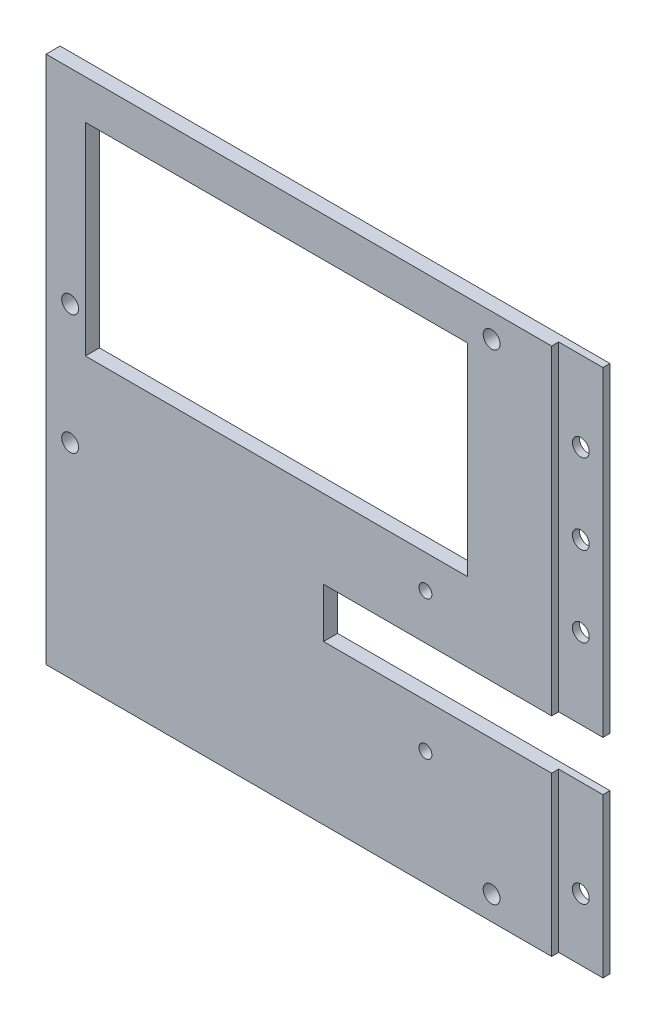
ISO-10303-21;
HEADER;
FILE_DESCRIPTION(('STEP AP214'),'2;1');
FILE_NAME('part.step','',(''),(''),'','','');
FILE_SCHEMA(('AUTOMOTIVE_DESIGN { 1 0 10303 214 1 1 1 1 }'));
ENDSEC;
DATA;
#1=APPLICATION_CONTEXT('core data for automotive mechanical design processes');
#2=APPLICATION_PROTOCOL_DEFINITION('international standard','automotive_design',2000,#1);
#3=PRODUCT_CONTEXT('',#1,'mechanical');
#4=PRODUCT('Part','Part','',(#3));
#5=PRODUCT_RELATED_PRODUCT_CATEGORY('part','',(#4));
#6=PRODUCT_DEFINITION_FORMATION('','',#4);
#7=PRODUCT_DEFINITION_CONTEXT('part definition',#1,'design');
#8=PRODUCT_DEFINITION('design','',#6,#7);
#9=PRODUCT_DEFINITION_SHAPE('','',#8);
#10=(LENGTH_UNIT() NAMED_UNIT(*) SI_UNIT(.MILLI.,.METRE.));
#11=(NAMED_UNIT(*) PLANE_ANGLE_UNIT() SI_UNIT($,.RADIAN.));
#12=(NAMED_UNIT(*) SI_UNIT($,.STERADIAN.) SOLID_ANGLE_UNIT());
#13=UNCERTAINTY_MEASURE_WITH_UNIT(LENGTH_MEASURE(1.E-05),#10,'distance_accuracy_value','');
#14=(GEOMETRIC_REPRESENTATION_CONTEXT(3) GLOBAL_UNCERTAINTY_ASSIGNED_CONTEXT((#13)) GLOBAL_UNIT_ASSIGNED_CONTEXT((#10,
#11,#12)) REPRESENTATION_CONTEXT('',''));
#15=CARTESIAN_POINT('',(0.,0.,0.));
#16=DIRECTION('',(0.,0.,1.));
#17=DIRECTION('',(1.,0.,0.));
#18=AXIS2_PLACEMENT_3D('',#15,#16,#17);
#19=CARTESIAN_POINT('',(0.,0.,3.175));
#20=DIRECTION('',(0.,0.,1.));
#21=DIRECTION('',(1.,0.,0.));
#22=AXIS2_PLACEMENT_3D('',#19,#20,#21);
#23=PLANE('',#22);
#24=CARTESIAN_POINT('',(64.3536557377049,-53.2993903200624,3.175));
#25=DIRECTION('',(0.,0.,1.));
#26=DIRECTION('',(1.,0.,0.));
#27=AXIS2_PLACEMENT_3D('',#24,#25,#26);
#28=CIRCLE('',#27,1.46);
#29=CARTESIAN_POINT('',(65.8136557377049,-53.2993903200624,3.175));
#30=VERTEX_POINT('',#29);
#31=EDGE_CURVE('E277',#30,#30,#28,.F.);
#32=ORIENTED_EDGE('',*,*,#31,.T.);
#33=EDGE_LOOP('',(#32));
#34=FACE_BOUND('',#33,.T.);
#35=CARTESIAN_POINT('',(-15.8673442622951,-64.4223903200624,3.175));
#36=DIRECTION('',(0.,0.,1.));
#37=DIRECTION('',(1.,0.,0.));
#38=AXIS2_PLACEMENT_3D('',#35,#36,#37);
#39=CIRCLE('',#38,1.905);
#40=CARTESIAN_POINT('',(-13.9623442622951,-64.4223903200624,3.175));
#41=VERTEX_POINT('',#40);
#42=EDGE_CURVE('E266',#41,#41,#39,.F.);
#43=ORIENTED_EDGE('',*,*,#42,.T.);
#44=EDGE_LOOP('',(#43));
#45=FACE_BOUND('',#44,.T.);
#46=DIRECTION('',(-1.,0.,0.));
#47=VECTOR('',#46,1.);
#48=CARTESIAN_POINT('',(0.,-45.7703903200625,3.175));
#49=LINE('',#48,#47);
#50=CARTESIAN_POINT('',(73.8706557377049,-45.7703903200625,3.175));
#51=VERTEX_POINT('',#50);
#52=CARTESIAN_POINT('',(-12.4293442622951,-45.7703903200625,3.175));
#53=VERTEX_POINT('',#52);
#54=EDGE_CURVE('E260',#51,#53,#49,.T.);
#55=ORIENTED_EDGE('',*,*,#54,.T.);
#56=DIRECTION('',(0.,1.,0.));
#57=VECTOR('',#56,1.);
#58=CARTESIAN_POINT('',(-12.4293442622951,0.,3.175));
#59=LINE('',#58,#57);
#60=CARTESIAN_POINT('',(-12.4293442622951,-0.0703903200624523,3.175));
#61=VERTEX_POINT('',#60);
#62=EDGE_CURVE('E263',#53,#61,#59,.T.);
#63=ORIENTED_EDGE('',*,*,#62,.T.);
#64=DIRECTION('',(1.,0.,0.));
#65=VECTOR('',#64,1.);
#66=CARTESIAN_POINT('',(0.,-0.070390320062452,3.175));
#67=LINE('',#66,#65);
#68=CARTESIAN_POINT('',(73.8706557377049,-0.0703903200624503,3.175));
#69=VERTEX_POINT('',#68);
#70=EDGE_CURVE('E254',#61,#69,#67,.T.);
#71=ORIENTED_EDGE('',*,*,#70,.T.);
#72=DIRECTION('',(0.,-1.,0.));
#73=VECTOR('',#72,1.);
#74=CARTESIAN_POINT('',(73.8706557377049,0.,3.175));
#75=LINE('',#74,#73);
#76=EDGE_CURVE('E257',#69,#51,#75,.T.);
#77=ORIENTED_EDGE('',*,*,#76,.T.);
#78=EDGE_LOOP('',(#55,#63,#71,#77));
#79=FACE_BOUND('',#78,.T.);
#80=CARTESIAN_POINT('',(79.3026557377049,3.36760967993755,3.175));
#81=DIRECTION('',(0.,0.,1.));
#82=DIRECTION('',(1.,0.,0.));
#83=AXIS2_PLACEMENT_3D('',#80,#81,#82);
#84=CIRCLE('',#83,1.90500000000001);
#85=CARTESIAN_POINT('',(81.2076557377049,3.36760967993755,3.175));
#86=VERTEX_POINT('',#85);
#87=EDGE_CURVE('E251',#86,#86,#84,.F.);
#88=ORIENTED_EDGE('',*,*,#87,.T.);
#89=EDGE_LOOP('',(#88));
#90=FACE_BOUND('',#89,.T.);
#91=CARTESIAN_POINT('',(79.3006557377049,-105.108390320062,3.175));
#92=DIRECTION('',(0.,0.,1.));
#93=DIRECTION('',(1.,0.,0.));
#94=AXIS2_PLACEMENT_3D('',#91,#92,#93);
#95=CIRCLE('',#94,1.90500000000001);
#96=CARTESIAN_POINT('',(81.2056557377049,-105.108390320062,3.175));
#97=VERTEX_POINT('',#96);
#98=EDGE_CURVE('E248',#97,#97,#95,.F.);
#99=ORIENTED_EDGE('',*,*,#98,.T.);
#100=EDGE_LOOP('',(#99));
#101=FACE_BOUND('',#100,.T.);
#102=CARTESIAN_POINT('',(64.3536557377049,-84.6493903200624,3.175));
#103=DIRECTION('',(0.,0.,1.));
#104=DIRECTION('',(1.,0.,0.));
#105=AXIS2_PLACEMENT_3D('',#102,#103,#104);
#106=CIRCLE('',#105,1.45999999999998);
#107=CARTESIAN_POINT('',(65.8136557377049,-84.6493903200624,3.175));
#108=VERTEX_POINT('',#107);
#109=EDGE_CURVE('E245',#108,#108,#106,.F.);
#110=ORIENTED_EDGE('',*,*,#109,.T.);
#111=EDGE_LOOP('',(#110));
#112=FACE_BOUND('',#111,.T.);
#113=CARTESIAN_POINT('',(-15.8673442622951,-37.3203903200625,3.175));
#114=DIRECTION('',(0.,0.,1.));
#115=DIRECTION('',(1.,0.,0.));
#116=AXIS2_PLACEMENT_3D('',#113,#114,#115);
#117=CIRCLE('',#116,1.905);
#118=CARTESIAN_POINT('',(-13.9623442622951,-37.3203903200625,3.175));
#119=VERTEX_POINT('',#118);
#120=EDGE_CURVE('E242',#119,#119,#117,.F.);
#121=ORIENTED_EDGE('',*,*,#120,.T.);
#122=EDGE_LOOP('',(#121));
#123=FACE_BOUND('',#122,.T.);
#124=DIRECTION('',(1.,0.,0.));
#125=VECTOR('',#124,1.);
#126=CARTESIAN_POINT('',(-21.3193442622951,-110.560390320062,3.175));
#127=LINE('',#126,#125);
#128=CARTESIAN_POINT('',(-21.3193442622951,-110.560390320062,3.175));
#129=VERTEX_POINT('',#128);
#130=CARTESIAN_POINT('',(92.8536557377049,-110.560390320062,3.17500006353088));
#131=VERTEX_POINT('',#130);
#132=EDGE_CURVE('E284',#129,#131,#127,.T.);
#133=ORIENTED_EDGE('',*,*,#132,.T.);
#134=DIRECTION('',(0.,-1.,0.));
#135=VECTOR('',#134,1.);
#136=CARTESIAN_POINT('',(92.8536557377049,8.81961037541127,3.17500006353089));
#137=LINE('',#136,#135);
#138=CARTESIAN_POINT('',(92.8536557377049,-74.7133903200625,3.17500006353088));
#139=VERTEX_POINT('',#138);
#140=EDGE_CURVE('E331',#139,#131,#137,.T.);
#141=ORIENTED_EDGE('',*,*,#140,.F.);
#142=DIRECTION('',(-1.,0.,0.));
#143=VECTOR('',#142,1.);
#144=CARTESIAN_POINT('',(0.,-74.7133903200625,3.175));
#145=LINE('',#144,#143);
#146=CARTESIAN_POINT('',(41.3536557377049,-74.7133903200625,3.175));
#147=VERTEX_POINT('',#146);
#148=EDGE_CURVE('E272',#139,#147,#145,.T.);
#149=ORIENTED_EDGE('',*,*,#148,.T.);
#150=DIRECTION('',(0.,1.,0.));
#151=VECTOR('',#150,1.);
#152=CARTESIAN_POINT('',(41.3536557377049,0.,3.175));
#153=LINE('',#152,#151);
#154=CARTESIAN_POINT('',(41.3536557377049,-63.5133903200624,3.175));
#155=VERTEX_POINT('',#154);
#156=EDGE_CURVE('E274',#147,#155,#153,.T.);
#157=ORIENTED_EDGE('',*,*,#156,.T.);
#158=DIRECTION('',(1.,0.,0.));
#159=VECTOR('',#158,1.);
#160=CARTESIAN_POINT('',(0.,-63.5133903200624,3.175));
#161=LINE('',#160,#159);
#162=CARTESIAN_POINT('',(92.8536557377049,-63.5133903200624,3.175));
#163=VERTEX_POINT('',#162);
#164=EDGE_CURVE('E269',#155,#163,#161,.T.);
#165=ORIENTED_EDGE('',*,*,#164,.T.);
#166=CARTESIAN_POINT('',(92.8536557377049,8.81961037541127,3.17500006353089));
#167=VERTEX_POINT('',#166);
#168=EDGE_CURVE('E62',#167,#163,#137,.T.);
#169=ORIENTED_EDGE('',*,*,#168,.F.);
#170=DIRECTION('',(-1.,0.,0.));
#171=VECTOR('',#170,1.);
#172=CARTESIAN_POINT('',(-21.3193442622951,8.81960967993755,3.175));
#173=LINE('',#172,#171);
#174=CARTESIAN_POINT('',(-21.3193442622951,8.81960967993755,3.175));
#175=VERTEX_POINT('',#174);
#176=EDGE_CURVE('E169',#167,#175,#173,.T.);
#177=ORIENTED_EDGE('',*,*,#176,.T.);
#178=DIRECTION('',(0.,-1.,0.));
#179=VECTOR('',#178,1.);
#180=CARTESIAN_POINT('',(-21.3193442622951,8.81960967993755,3.175));
#181=LINE('',#180,#179);
#182=EDGE_CURVE('E281',#175,#129,#181,.T.);
#183=ORIENTED_EDGE('',*,*,#182,.T.);
#184=EDGE_LOOP('',(#133,#141,#149,#157,#165,#169,#177,#183));
#185=FACE_BOUND('',#184,.T.);
#186=ADVANCED_FACE('F37',(#34,#45,#79,#90,#101,#112,#123,#185),#23,.T.);
#187=CARTESIAN_POINT('',(102.853655737705,8.81960967993755,3.175));
#188=DIRECTION('',(-1.,0.,0.));
#189=DIRECTION('',(0.,-1.,0.));
#190=AXIS2_PLACEMENT_3D('',#187,#188,#189);
#191=PLANE('',#190);
#192=DIRECTION('',(0.,0.,-1.));
#193=VECTOR('',#192,1.);
#194=CARTESIAN_POINT('',(102.853655737705,-74.7133903200625,14.175));
#195=LINE('',#194,#193);
#196=CARTESIAN_POINT('',(102.853655737705,-74.7133903200625,1.58500006353088));
#197=VERTEX_POINT('',#196);
#198=CARTESIAN_POINT('',(102.853655737705,-74.7133903200625,0.));
#199=VERTEX_POINT('',#198);
#200=EDGE_CURVE('E209',#197,#199,#195,.T.);
#201=ORIENTED_EDGE('',*,*,#200,.F.);
#202=DIRECTION('',(0.,1.,0.));
#203=VECTOR('',#202,1.);
#204=CARTESIAN_POINT('',(102.853655737705,8.81961037541127,1.58500006353089));
#205=LINE('',#204,#203);
#206=CARTESIAN_POINT('',(102.853655737705,-110.560390320062,1.58500006353088));
#207=VERTEX_POINT('',#206);
#208=EDGE_CURVE('E173',#207,#197,#205,.T.);
#209=ORIENTED_EDGE('',*,*,#208,.F.);
#210=DIRECTION('',(0.,0.,-1.));
#211=VECTOR('',#210,1.);
#212=CARTESIAN_POINT('',(102.853655737705,-110.560390320062,3.175));
#213=LINE('',#212,#211);
#214=CARTESIAN_POINT('',(102.853655737705,-110.560390320062,0.));
#215=VERTEX_POINT('',#214);
#216=EDGE_CURVE('E304',#207,#215,#213,.T.);
#217=ORIENTED_EDGE('',*,*,#216,.T.);
#218=DIRECTION('',(0.,1.,0.));
#219=VECTOR('',#218,1.);
#220=CARTESIAN_POINT('',(102.853655737705,8.81960967993755,0.));
#221=LINE('',#220,#219);
#222=EDGE_CURVE('E296',#215,#199,#221,.T.);
#223=ORIENTED_EDGE('',*,*,#222,.T.);
#224=EDGE_LOOP('',(#201,#209,#217,#223));
#225=FACE_BOUND('',#224,.T.);
#226=ADVANCED_FACE('F345',(#225),#191,.F.);
#227=DIRECTION('',(0.,0.,-1.));
#228=VECTOR('',#227,1.);
#229=CARTESIAN_POINT('',(102.853655737705,8.81960967993755,3.175));
#230=LINE('',#229,#228);
#231=CARTESIAN_POINT('',(102.853655737705,8.81961037541127,1.58500006353089));
#232=VERTEX_POINT('',#231);
#233=CARTESIAN_POINT('',(102.853655737705,8.81960967993755,0.));
#234=VERTEX_POINT('',#233);
#235=EDGE_CURVE('E302',#232,#234,#230,.T.);
#236=ORIENTED_EDGE('',*,*,#235,.F.);
#237=CARTESIAN_POINT('',(102.853655737705,-63.5133903200624,1.58500006353088));
#238=VERTEX_POINT('',#237);
#239=EDGE_CURVE('E161',#238,#232,#205,.T.);
#240=ORIENTED_EDGE('',*,*,#239,.F.);
#241=DIRECTION('',(0.,0.,-1.));
#242=VECTOR('',#241,1.);
#243=CARTESIAN_POINT('',(102.853655737705,-63.5133903200624,14.175));
#244=LINE('',#243,#242);
#245=CARTESIAN_POINT('',(102.853655737705,-63.5133903200624,0.));
#246=VERTEX_POINT('',#245);
#247=EDGE_CURVE('E207',#238,#246,#244,.T.);
#248=ORIENTED_EDGE('',*,*,#247,.T.);
#249=EDGE_CURVE('E295',#246,#234,#221,.T.);
#250=ORIENTED_EDGE('',*,*,#249,.T.);
#251=EDGE_LOOP('',(#236,#240,#248,#250));
#252=FACE_BOUND('',#251,.T.);
#253=ADVANCED_FACE('F382',(#252),#191,.F.);
#254=CARTESIAN_POINT('',(-21.3193442622951,8.81960967993755,3.175));
#255=DIRECTION('',(1.,0.,0.));
#256=DIRECTION('',(0.,1.,0.));
#257=AXIS2_PLACEMENT_3D('',#254,#255,#256);
#258=PLANE('',#257);
#259=DIRECTION('',(0.,-1.,0.));
#260=VECTOR('',#259,1.);
#261=CARTESIAN_POINT('',(-21.3193442622951,8.81960967993755,0.));
#262=LINE('',#261,#260);
#263=CARTESIAN_POINT('',(-21.3193442622951,8.81960967993755,0.));
#264=VERTEX_POINT('',#263);
#265=CARTESIAN_POINT('',(-21.3193442622951,-110.560390320062,0.));
#266=VERTEX_POINT('',#265);
#267=EDGE_CURVE('E280',#264,#266,#262,.T.);
#268=ORIENTED_EDGE('',*,*,#267,.T.);
#269=DIRECTION('',(0.,0.,-1.));
#270=VECTOR('',#269,1.);
#271=CARTESIAN_POINT('',(-21.3193442622951,-110.560390320062,3.175));
#272=LINE('',#271,#270);
#273=EDGE_CURVE('E306',#129,#266,#272,.T.);
#274=ORIENTED_EDGE('',*,*,#273,.F.);
#275=ORIENTED_EDGE('',*,*,#182,.F.);
#276=DIRECTION('',(0.,0.,-1.));
#277=VECTOR('',#276,1.);
#278=CARTESIAN_POINT('',(-21.3193442622951,8.81960967993755,3.175));
#279=LINE('',#278,#277);
#280=EDGE_CURVE('E289',#175,#264,#279,.T.);
#281=ORIENTED_EDGE('',*,*,#280,.T.);
#282=EDGE_LOOP('',(#268,#274,#275,#281));
#283=FACE_BOUND('',#282,.T.);
#284=ADVANCED_FACE('F39',(#283),#258,.F.);
#285=CARTESIAN_POINT('',(-21.3193442622951,-110.560390320062,3.175));
#286=DIRECTION('',(0.,1.,0.));
#287=DIRECTION('',(0.,0.,1.));
#288=AXIS2_PLACEMENT_3D('',#285,#286,#287);
#289=PLANE('',#288);
#290=ORIENTED_EDGE('',*,*,#216,.F.);
#291=DIRECTION('',(-1.,0.,0.));
#292=VECTOR('',#291,1.);
#293=CARTESIAN_POINT('',(-21.3193442622951,-110.560390320062,1.58500006353088));
#294=LINE('',#293,#292);
#295=CARTESIAN_POINT('',(92.8536557377049,-110.560390320062,1.58500006353088));
#296=VERTEX_POINT('',#295);
#297=EDGE_CURVE('E182',#207,#296,#294,.T.);
#298=ORIENTED_EDGE('',*,*,#297,.T.);
#299=DIRECTION('',(0.,0.,-1.));
#300=VECTOR('',#299,1.);
#301=CARTESIAN_POINT('',(92.8536557377049,-110.560390320062,3.175));
#302=LINE('',#301,#300);
#303=EDGE_CURVE('E178',#131,#296,#302,.T.);
#304=ORIENTED_EDGE('',*,*,#303,.F.);
#305=ORIENTED_EDGE('',*,*,#132,.F.);
#306=ORIENTED_EDGE('',*,*,#273,.T.);
#307=DIRECTION('',(1.,0.,0.));
#308=VECTOR('',#307,1.);
#309=CARTESIAN_POINT('',(-21.3193442622951,-110.560390320062,0.));
#310=LINE('',#309,#308);
#311=EDGE_CURVE('E292',#266,#215,#310,.T.);
#312=ORIENTED_EDGE('',*,*,#311,.T.);
#313=EDGE_LOOP('',(#290,#298,#304,#305,#306,#312));
#314=FACE_BOUND('',#313,.T.);
#315=ADVANCED_FACE('F360',(#314),#289,.F.);
#316=CARTESIAN_POINT('',(-21.3193442622951,8.81960967993755,3.175));
#317=DIRECTION('',(0.,-1.,0.));
#318=DIRECTION('',(0.,0.,-1.));
#319=AXIS2_PLACEMENT_3D('',#316,#317,#318);
#320=PLANE('',#319);
#321=DIRECTION('',(0.,0.,1.));
#322=VECTOR('',#321,1.);
#323=CARTESIAN_POINT('',(92.8536557377049,8.81961037541127,3.17500006353089));
#324=LINE('',#323,#322);
#325=CARTESIAN_POINT('',(92.8536557377049,8.81961037541127,1.58500006353089));
#326=VERTEX_POINT('',#325);
#327=EDGE_CURVE('E153',#326,#167,#324,.T.);
#328=ORIENTED_EDGE('',*,*,#327,.F.);
#329=DIRECTION('',(1.,0.,0.));
#330=VECTOR('',#329,1.);
#331=CARTESIAN_POINT('',(92.8536557377049,8.81961037541127,1.58500006353089));
#332=LINE('',#331,#330);
#333=EDGE_CURVE('E158',#326,#232,#332,.T.);
#334=ORIENTED_EDGE('',*,*,#333,.T.);
#335=ORIENTED_EDGE('',*,*,#235,.T.);
#336=DIRECTION('',(-1.,0.,0.));
#337=VECTOR('',#336,1.);
#338=CARTESIAN_POINT('',(-21.3193442622951,8.81960967993755,0.));
#339=LINE('',#338,#337);
#340=EDGE_CURVE('E285',#234,#264,#339,.T.);
#341=ORIENTED_EDGE('',*,*,#340,.T.);
#342=ORIENTED_EDGE('',*,*,#280,.F.);
#343=ORIENTED_EDGE('',*,*,#176,.F.);
#344=EDGE_LOOP('',(#328,#334,#335,#341,#342,#343));
#345=FACE_BOUND('',#344,.T.);
#346=ADVANCED_FACE('F167',(#345),#320,.F.);
#347=CARTESIAN_POINT('',(0.,0.,0.));
#348=DIRECTION('',(0.,0.,1.));
#349=DIRECTION('',(1.,0.,0.));
#350=AXIS2_PLACEMENT_3D('',#347,#348,#349);
#351=PLANE('',#350);
#352=CARTESIAN_POINT('',(97.8536557377049,-9.26288962458873,0.));
#353=DIRECTION('',(0.,0.,1.));
#354=DIRECTION('',(1.,0.,0.));
#355=AXIS2_PLACEMENT_3D('',#352,#353,#354);
#356=CIRCLE('',#355,1.90500000000001);
#357=CARTESIAN_POINT('',(99.7586557377049,-9.26288962458873,0.));
#358=VERTEX_POINT('',#357);
#359=EDGE_CURVE('E174',#358,#358,#356,.T.);
#360=ORIENTED_EDGE('',*,*,#359,.T.);
#361=EDGE_LOOP('',(#360));
#362=FACE_BOUND('',#361,.T.);
#363=CARTESIAN_POINT('',(97.8536557377049,-27.3453896245887,0.));
#364=DIRECTION('',(0.,0.,1.));
#365=DIRECTION('',(1.,0.,0.));
#366=AXIS2_PLACEMENT_3D('',#363,#364,#365);
#367=CIRCLE('',#366,1.90500000000001);
#368=CARTESIAN_POINT('',(99.7586557377049,-27.3453896245887,0.));
#369=VERTEX_POINT('',#368);
#370=EDGE_CURVE('E319',#369,#369,#367,.T.);
#371=ORIENTED_EDGE('',*,*,#370,.T.);
#372=EDGE_LOOP('',(#371));
#373=FACE_BOUND('',#372,.T.);
#374=CARTESIAN_POINT('',(97.8536557377049,-45.4308903200625,0.));
#375=DIRECTION('',(0.,0.,1.));
#376=DIRECTION('',(1.,0.,0.));
#377=AXIS2_PLACEMENT_3D('',#374,#375,#376);
#378=CIRCLE('',#377,1.90500000000001);
#379=CARTESIAN_POINT('',(99.7586557377049,-45.4308903200625,0.));
#380=VERTEX_POINT('',#379);
#381=EDGE_CURVE('E316',#380,#380,#378,.T.);
#382=ORIENTED_EDGE('',*,*,#381,.T.);
#383=EDGE_LOOP('',(#382));
#384=FACE_BOUND('',#383,.T.);
#385=CARTESIAN_POINT('',(97.8536557377049,-96.5603903200625,0.));
#386=DIRECTION('',(0.,0.,1.));
#387=DIRECTION('',(1.,0.,0.));
#388=AXIS2_PLACEMENT_3D('',#385,#386,#387);
#389=CIRCLE('',#388,1.90500000000001);
#390=CARTESIAN_POINT('',(99.7586557377049,-96.5603903200625,0.));
#391=VERTEX_POINT('',#390);
#392=EDGE_CURVE('E313',#391,#391,#389,.T.);
#393=ORIENTED_EDGE('',*,*,#392,.T.);
#394=EDGE_LOOP('',(#393));
#395=FACE_BOUND('',#394,.T.);
#396=CARTESIAN_POINT('',(64.3536557377049,-53.2993903200624,0.));
#397=DIRECTION('',(0.,0.,1.));
#398=DIRECTION('',(1.,0.,0.));
#399=AXIS2_PLACEMENT_3D('',#396,#397,#398);
#400=CIRCLE('',#399,1.46);
#401=CARTESIAN_POINT('',(65.8136557377049,-53.2993903200624,0.));
#402=VERTEX_POINT('',#401);
#403=EDGE_CURVE('E189',#402,#402,#400,.T.);
#404=ORIENTED_EDGE('',*,*,#403,.T.);
#405=EDGE_LOOP('',(#404));
#406=FACE_BOUND('',#405,.T.);
#407=DIRECTION('',(1.,0.,0.));
#408=VECTOR('',#407,1.);
#409=CARTESIAN_POINT('',(41.3536557377049,-74.7133903200625,0.));
#410=LINE('',#409,#408);
#411=CARTESIAN_POINT('',(41.3536557377049,-74.7133903200625,0.));
#412=VERTEX_POINT('',#411);
#413=EDGE_CURVE('E198',#412,#199,#410,.T.);
#414=ORIENTED_EDGE('',*,*,#413,.T.);
#415=ORIENTED_EDGE('',*,*,#222,.F.);
#416=ORIENTED_EDGE('',*,*,#311,.F.);
#417=ORIENTED_EDGE('',*,*,#267,.F.);
#418=ORIENTED_EDGE('',*,*,#340,.F.);
#419=ORIENTED_EDGE('',*,*,#249,.F.);
#420=DIRECTION('',(-1.,0.,0.));
#421=VECTOR('',#420,1.);
#422=CARTESIAN_POINT('',(41.3536557377049,-63.5133903200624,0.));
#423=LINE('',#422,#421);
#424=CARTESIAN_POINT('',(41.3536557377049,-63.5133903200624,0.));
#425=VERTEX_POINT('',#424);
#426=EDGE_CURVE('E201',#246,#425,#423,.T.);
#427=ORIENTED_EDGE('',*,*,#426,.T.);
#428=DIRECTION('',(0.,-1.,0.));
#429=VECTOR('',#428,1.);
#430=CARTESIAN_POINT('',(41.3536557377049,-63.5133903200624,0.));
#431=LINE('',#430,#429);
#432=EDGE_CURVE('E195',#425,#412,#431,.T.);
#433=ORIENTED_EDGE('',*,*,#432,.T.);
#434=EDGE_LOOP('',(#414,#415,#416,#417,#418,#419,#427,#433));
#435=FACE_BOUND('',#434,.T.);
#436=CARTESIAN_POINT('',(-15.8673442622951,-64.4223903200624,0.));
#437=DIRECTION('',(0.,0.,1.));
#438=DIRECTION('',(1.,0.,0.));
#439=AXIS2_PLACEMENT_3D('',#436,#437,#438);
#440=CIRCLE('',#439,1.905);
#441=CARTESIAN_POINT('',(-13.9623442622951,-64.4223903200624,0.));
#442=VERTEX_POINT('',#441);
#443=EDGE_CURVE('E213',#442,#442,#440,.T.);
#444=ORIENTED_EDGE('',*,*,#443,.T.);
#445=EDGE_LOOP('',(#444));
#446=FACE_BOUND('',#445,.T.);
#447=DIRECTION('',(0.,-1.,0.));
#448=VECTOR('',#447,1.);
#449=CARTESIAN_POINT('',(-12.4293442622951,-0.0703903200624523,0.));
#450=LINE('',#449,#448);
#451=CARTESIAN_POINT('',(-12.4293442622951,-0.0703903200624523,0.));
#452=VERTEX_POINT('',#451);
#453=CARTESIAN_POINT('',(-12.4293442622951,-45.7703903200625,0.));
#454=VERTEX_POINT('',#453);
#455=EDGE_CURVE('E216',#452,#454,#450,.T.);
#456=ORIENTED_EDGE('',*,*,#455,.T.);
#457=DIRECTION('',(1.,0.,0.));
#458=VECTOR('',#457,1.);
#459=CARTESIAN_POINT('',(-12.4293442622951,-45.7703903200625,0.));
#460=LINE('',#459,#458);
#461=CARTESIAN_POINT('',(73.8706557377049,-45.7703903200625,0.));
#462=VERTEX_POINT('',#461);
#463=EDGE_CURVE('E219',#454,#462,#460,.T.);
#464=ORIENTED_EDGE('',*,*,#463,.T.);
#465=DIRECTION('',(0.,1.,0.));
#466=VECTOR('',#465,1.);
#467=CARTESIAN_POINT('',(73.8706557377049,-0.0703903200624503,0.));
#468=LINE('',#467,#466);
#469=CARTESIAN_POINT('',(73.8706557377049,-0.0703903200624503,0.));
#470=VERTEX_POINT('',#469);
#471=EDGE_CURVE('E222',#462,#470,#468,.T.);
#472=ORIENTED_EDGE('',*,*,#471,.T.);
#473=DIRECTION('',(-1.,0.,0.));
#474=VECTOR('',#473,1.);
#475=CARTESIAN_POINT('',(-12.4293442622951,-0.0703903200624523,0.));
#476=LINE('',#475,#474);
#477=EDGE_CURVE('E225',#470,#452,#476,.T.);
#478=ORIENTED_EDGE('',*,*,#477,.T.);
#479=EDGE_LOOP('',(#456,#464,#472,#478));
#480=FACE_BOUND('',#479,.T.);
#481=CARTESIAN_POINT('',(79.3026557377049,3.36760967993755,0.));
#482=DIRECTION('',(0.,0.,1.));
#483=DIRECTION('',(1.,0.,0.));
#484=AXIS2_PLACEMENT_3D('',#481,#482,#483);
#485=CIRCLE('',#484,1.90500000000001);
#486=CARTESIAN_POINT('',(81.2076557377049,3.36760967993755,0.));
#487=VERTEX_POINT('',#486);
#488=EDGE_CURVE('E186',#487,#487,#485,.T.);
#489=ORIENTED_EDGE('',*,*,#488,.T.);
#490=EDGE_LOOP('',(#489));
#491=FACE_BOUND('',#490,.T.);
#492=CARTESIAN_POINT('',(79.3006557377049,-105.108390320062,0.));
#493=DIRECTION('',(0.,0.,1.));
#494=DIRECTION('',(1.,0.,0.));
#495=AXIS2_PLACEMENT_3D('',#492,#493,#494);
#496=CIRCLE('',#495,1.90500000000001);
#497=CARTESIAN_POINT('',(81.2056557377049,-105.108390320062,0.));
#498=VERTEX_POINT('',#497);
#499=EDGE_CURVE('E190',#498,#498,#496,.T.);
#500=ORIENTED_EDGE('',*,*,#499,.T.);
#501=EDGE_LOOP('',(#500));
#502=FACE_BOUND('',#501,.T.);
#503=CARTESIAN_POINT('',(64.3536557377049,-84.6493903200624,0.));
#504=DIRECTION('',(0.,0.,1.));
#505=DIRECTION('',(1.,0.,0.));
#506=AXIS2_PLACEMENT_3D('',#503,#504,#505);
#507=CIRCLE('',#506,1.45999999999998);
#508=CARTESIAN_POINT('',(65.8136557377049,-84.6493903200624,0.));
#509=VERTEX_POINT('',#508);
#510=EDGE_CURVE('E185',#509,#509,#507,.T.);
#511=ORIENTED_EDGE('',*,*,#510,.T.);
#512=EDGE_LOOP('',(#511));
#513=FACE_BOUND('',#512,.T.);
#514=CARTESIAN_POINT('',(-15.8673442622951,-37.3203903200625,0.));
#515=DIRECTION('',(0.,0.,1.));
#516=DIRECTION('',(1.,0.,0.));
#517=AXIS2_PLACEMENT_3D('',#514,#515,#516);
#518=CIRCLE('',#517,1.905);
#519=CARTESIAN_POINT('',(-13.9623442622951,-37.3203903200625,0.));
#520=VERTEX_POINT('',#519);
#521=EDGE_CURVE('E237',#520,#520,#518,.T.);
#522=ORIENTED_EDGE('',*,*,#521,.T.);
#523=EDGE_LOOP('',(#522));
#524=FACE_BOUND('',#523,.T.);
#525=ADVANCED_FACE('F348',(#362,#373,#384,#395,#406,#435,#446,#480,#491,#502,#513,#524),#351,.F.);
#526=CARTESIAN_POINT('',(-15.8673442622951,-37.3203903200625,14.175));
#527=DIRECTION('',(0.,0.,-1.));
#528=DIRECTION('',(-1.,0.,0.));
#529=AXIS2_PLACEMENT_3D('',#526,#527,#528);
#530=CYLINDRICAL_SURFACE('',#529,1.905);
#531=ORIENTED_EDGE('',*,*,#120,.F.);
#532=EDGE_LOOP('',(#531));
#533=FACE_BOUND('',#532,.T.);
#534=ORIENTED_EDGE('',*,*,#521,.F.);
#535=EDGE_LOOP('',(#534));
#536=FACE_BOUND('',#535,.T.);
#537=ADVANCED_FACE('F387',(#533,#536),#530,.F.);
#538=CARTESIAN_POINT('',(64.3536557377049,-84.6493903200624,14.175));
#539=DIRECTION('',(0.,0.,-1.));
#540=DIRECTION('',(-1.,0.,0.));
#541=AXIS2_PLACEMENT_3D('',#538,#539,#540);
#542=CYLINDRICAL_SURFACE('',#541,1.45999999999998);
#543=ORIENTED_EDGE('',*,*,#109,.F.);
#544=EDGE_LOOP('',(#543));
#545=FACE_BOUND('',#544,.T.);
#546=ORIENTED_EDGE('',*,*,#510,.F.);
#547=EDGE_LOOP('',(#546));
#548=FACE_BOUND('',#547,.T.);
#549=ADVANCED_FACE('F419',(#545,#548),#542,.F.);
#550=CARTESIAN_POINT('',(79.3006557377049,-105.108390320062,14.175));
#551=DIRECTION('',(0.,0.,-1.));
#552=DIRECTION('',(-1.,0.,0.));
#553=AXIS2_PLACEMENT_3D('',#550,#551,#552);
#554=CYLINDRICAL_SURFACE('',#553,1.90500000000001);
#555=ORIENTED_EDGE('',*,*,#98,.F.);
#556=EDGE_LOOP('',(#555));
#557=FACE_BOUND('',#556,.T.);
#558=ORIENTED_EDGE('',*,*,#499,.F.);
#559=EDGE_LOOP('',(#558));
#560=FACE_BOUND('',#559,.T.);
#561=ADVANCED_FACE('F463',(#557,#560),#554,.F.);
#562=CARTESIAN_POINT('',(79.3026557377049,3.36760967993755,14.175));
#563=DIRECTION('',(0.,0.,-1.));
#564=DIRECTION('',(-1.,0.,0.));
#565=AXIS2_PLACEMENT_3D('',#562,#563,#564);
#566=CYLINDRICAL_SURFACE('',#565,1.90500000000001);
#567=ORIENTED_EDGE('',*,*,#87,.F.);
#568=EDGE_LOOP('',(#567));
#569=FACE_BOUND('',#568,.T.);
#570=ORIENTED_EDGE('',*,*,#488,.F.);
#571=EDGE_LOOP('',(#570));
#572=FACE_BOUND('',#571,.T.);
#573=ADVANCED_FACE('F439',(#569,#572),#566,.F.);
#574=CARTESIAN_POINT('',(-12.4293442622951,-0.0703903200624523,14.175));
#575=DIRECTION('',(1.,0.,0.));
#576=DIRECTION('',(0.,1.,0.));
#577=AXIS2_PLACEMENT_3D('',#574,#575,#576);
#578=PLANE('',#577);
#579=DIRECTION('',(0.,0.,-1.));
#580=VECTOR('',#579,1.);
#581=CARTESIAN_POINT('',(-12.4293442622951,-45.7703903200625,14.175));
#582=LINE('',#581,#580);
#583=EDGE_CURVE('E235',#53,#454,#582,.T.);
#584=ORIENTED_EDGE('',*,*,#583,.T.);
#585=ORIENTED_EDGE('',*,*,#455,.F.);
#586=DIRECTION('',(0.,0.,-1.));
#587=VECTOR('',#586,1.);
#588=CARTESIAN_POINT('',(-12.4293442622951,-0.0703903200624523,14.175));
#589=LINE('',#588,#587);
#590=EDGE_CURVE('E228',#61,#452,#589,.T.);
#591=ORIENTED_EDGE('',*,*,#590,.F.);
#592=ORIENTED_EDGE('',*,*,#62,.F.);
#593=EDGE_LOOP('',(#584,#585,#591,#592));
#594=FACE_BOUND('',#593,.T.);
#595=ADVANCED_FACE('F436',(#594),#578,.T.);
#596=CARTESIAN_POINT('',(-12.4293442622951,-45.7703903200625,14.175));
#597=DIRECTION('',(0.,1.,0.));
#598=DIRECTION('',(0.,0.,1.));
#599=AXIS2_PLACEMENT_3D('',#596,#597,#598);
#600=PLANE('',#599);
#601=DIRECTION('',(0.,0.,-1.));
#602=VECTOR('',#601,1.);
#603=CARTESIAN_POINT('',(73.8706557377049,-45.7703903200625,14.175));
#604=LINE('',#603,#602);
#605=EDGE_CURVE('E233',#51,#462,#604,.T.);
#606=ORIENTED_EDGE('',*,*,#605,.T.);
#607=ORIENTED_EDGE('',*,*,#463,.F.);
#608=ORIENTED_EDGE('',*,*,#583,.F.);
#609=ORIENTED_EDGE('',*,*,#54,.F.);
#610=EDGE_LOOP('',(#606,#607,#608,#609));
#611=FACE_BOUND('',#610,.T.);
#612=ADVANCED_FACE('F432',(#611),#600,.T.);
#613=CARTESIAN_POINT('',(73.8706557377049,-0.0703903200624503,14.175));
#614=DIRECTION('',(-1.,0.,0.));
#615=DIRECTION('',(0.,0.,1.));
#616=AXIS2_PLACEMENT_3D('',#613,#614,#615);
#617=PLANE('',#616);
#618=DIRECTION('',(0.,0.,-1.));
#619=VECTOR('',#618,1.);
#620=CARTESIAN_POINT('',(73.8706557377049,-0.0703903200624503,14.175));
#621=LINE('',#620,#619);
#622=EDGE_CURVE('E231',#69,#470,#621,.T.);
#623=ORIENTED_EDGE('',*,*,#622,.T.);
#624=ORIENTED_EDGE('',*,*,#471,.F.);
#625=ORIENTED_EDGE('',*,*,#605,.F.);
#626=ORIENTED_EDGE('',*,*,#76,.F.);
#627=EDGE_LOOP('',(#623,#624,#625,#626));
#628=FACE_BOUND('',#627,.T.);
#629=ADVANCED_FACE('F428',(#628),#617,.T.);
#630=CARTESIAN_POINT('',(-12.4293442622951,-0.0703903200624523,14.175));
#631=DIRECTION('',(0.,-1.,0.));
#632=DIRECTION('',(1.,0.,0.));
#633=AXIS2_PLACEMENT_3D('',#630,#631,#632);
#634=PLANE('',#633);
#635=ORIENTED_EDGE('',*,*,#590,.T.);
#636=ORIENTED_EDGE('',*,*,#477,.F.);
#637=ORIENTED_EDGE('',*,*,#622,.F.);
#638=ORIENTED_EDGE('',*,*,#70,.F.);
#639=EDGE_LOOP('',(#635,#636,#637,#638));
#640=FACE_BOUND('',#639,.T.);
#641=ADVANCED_FACE('F425',(#640),#634,.T.);
#642=CARTESIAN_POINT('',(-15.8673442622951,-64.4223903200624,14.175));
#643=DIRECTION('',(0.,0.,-1.));
#644=DIRECTION('',(-1.,0.,0.));
#645=AXIS2_PLACEMENT_3D('',#642,#643,#644);
#646=CYLINDRICAL_SURFACE('',#645,1.905);
#647=ORIENTED_EDGE('',*,*,#42,.F.);
#648=EDGE_LOOP('',(#647));
#649=FACE_BOUND('',#648,.T.);
#650=ORIENTED_EDGE('',*,*,#443,.F.);
#651=EDGE_LOOP('',(#650));
#652=FACE_BOUND('',#651,.T.);
#653=ADVANCED_FACE('F423',(#649,#652),#646,.F.);
#654=CARTESIAN_POINT('',(41.3536557377049,-63.5133903200624,14.175));
#655=DIRECTION('',(1.,0.,0.));
#656=DIRECTION('',(0.,0.,-1.));
#657=AXIS2_PLACEMENT_3D('',#654,#655,#656);
#658=PLANE('',#657);
#659=DIRECTION('',(0.,0.,-1.));
#660=VECTOR('',#659,1.);
#661=CARTESIAN_POINT('',(41.3536557377049,-74.7133903200625,14.175));
#662=LINE('',#661,#660);
#663=EDGE_CURVE('E211',#147,#412,#662,.T.);
#664=ORIENTED_EDGE('',*,*,#663,.T.);
#665=ORIENTED_EDGE('',*,*,#432,.F.);
#666=DIRECTION('',(0.,0.,-1.));
#667=VECTOR('',#666,1.);
#668=CARTESIAN_POINT('',(41.3536557377049,-63.5133903200624,14.175));
#669=LINE('',#668,#667);
#670=EDGE_CURVE('E204',#155,#425,#669,.T.);
#671=ORIENTED_EDGE('',*,*,#670,.F.);
#672=ORIENTED_EDGE('',*,*,#156,.F.);
#673=EDGE_LOOP('',(#664,#665,#671,#672));
#674=FACE_BOUND('',#673,.T.);
#675=ADVANCED_FACE('F354',(#674),#658,.T.);
#676=CARTESIAN_POINT('',(41.3536557377049,-74.7133903200625,14.175));
#677=DIRECTION('',(0.,1.,0.));
#678=DIRECTION('',(0.,0.,1.));
#679=AXIS2_PLACEMENT_3D('',#676,#677,#678);
#680=PLANE('',#679);
#681=DIRECTION('',(-1.,0.,0.));
#682=VECTOR('',#681,1.);
#683=CARTESIAN_POINT('',(41.3536557377049,-74.7133903200625,1.58500006353088));
#684=LINE('',#683,#682);
#685=CARTESIAN_POINT('',(92.8536557377049,-74.7133903200625,1.58500006353088));
#686=VERTEX_POINT('',#685);
#687=EDGE_CURVE('E180',#197,#686,#684,.T.);
#688=ORIENTED_EDGE('',*,*,#687,.F.);
#689=ORIENTED_EDGE('',*,*,#200,.T.);
#690=ORIENTED_EDGE('',*,*,#413,.F.);
#691=ORIENTED_EDGE('',*,*,#663,.F.);
#692=ORIENTED_EDGE('',*,*,#148,.F.);
#693=DIRECTION('',(0.,0.,-1.));
#694=VECTOR('',#693,1.);
#695=CARTESIAN_POINT('',(92.8536557377049,-74.7133903200625,14.175));
#696=LINE('',#695,#694);
#697=EDGE_CURVE('E164',#139,#686,#696,.T.);
#698=ORIENTED_EDGE('',*,*,#697,.T.);
#699=EDGE_LOOP('',(#688,#689,#690,#691,#692,#698));
#700=FACE_BOUND('',#699,.T.);
#701=ADVANCED_FACE('F342',(#700),#680,.T.);
#702=CARTESIAN_POINT('',(41.3536557377049,-63.5133903200624,14.175));
#703=DIRECTION('',(0.,-1.,0.));
#704=DIRECTION('',(0.,0.,-1.));
#705=AXIS2_PLACEMENT_3D('',#702,#703,#704);
#706=PLANE('',#705);
#707=DIRECTION('',(1.,0.,0.));
#708=VECTOR('',#707,1.);
#709=CARTESIAN_POINT('',(41.3536557377049,-63.5133903200624,1.58500006353088));
#710=LINE('',#709,#708);
#711=CARTESIAN_POINT('',(92.8536557377049,-63.5133903200624,1.58500006353088));
#712=VERTEX_POINT('',#711);
#713=EDGE_CURVE('E11',#712,#238,#710,.T.);
#714=ORIENTED_EDGE('',*,*,#713,.F.);
#715=DIRECTION('',(0.,0.,1.));
#716=VECTOR('',#715,1.);
#717=CARTESIAN_POINT('',(92.8536557377049,-63.5133903200624,14.175));
#718=LINE('',#717,#716);
#719=EDGE_CURVE('E46',#712,#163,#718,.T.);
#720=ORIENTED_EDGE('',*,*,#719,.T.);
#721=ORIENTED_EDGE('',*,*,#164,.F.);
#722=ORIENTED_EDGE('',*,*,#670,.T.);
#723=ORIENTED_EDGE('',*,*,#426,.F.);
#724=ORIENTED_EDGE('',*,*,#247,.F.);
#725=EDGE_LOOP('',(#714,#720,#721,#722,#723,#724));
#726=FACE_BOUND('',#725,.T.);
#727=ADVANCED_FACE('F408',(#726),#706,.T.);
#728=CARTESIAN_POINT('',(64.3536557377049,-53.2993903200624,14.175));
#729=DIRECTION('',(0.,0.,-1.));
#730=DIRECTION('',(-1.,0.,0.));
#731=AXIS2_PLACEMENT_3D('',#728,#729,#730);
#732=CYLINDRICAL_SURFACE('',#731,1.46);
#733=ORIENTED_EDGE('',*,*,#31,.F.);
#734=EDGE_LOOP('',(#733));
#735=FACE_BOUND('',#734,.T.);
#736=ORIENTED_EDGE('',*,*,#403,.F.);
#737=EDGE_LOOP('',(#736));
#738=FACE_BOUND('',#737,.T.);
#739=ADVANCED_FACE('F375',(#735,#738),#732,.F.);
#740=CARTESIAN_POINT('',(92.8536557377049,0.,0.));
#741=DIRECTION('',(1.,0.,0.));
#742=DIRECTION('',(0.,1.,0.));
#743=AXIS2_PLACEMENT_3D('',#740,#741,#742);
#744=PLANE('',#743);
#745=DIRECTION('',(0.,1.,0.));
#746=VECTOR('',#745,1.);
#747=CARTESIAN_POINT('',(92.8536557377049,8.81961037541127,1.58500006353089));
#748=LINE('',#747,#746);
#749=EDGE_CURVE('E149',#712,#326,#748,.T.);
#750=ORIENTED_EDGE('',*,*,#749,.T.);
#751=ORIENTED_EDGE('',*,*,#327,.T.);
#752=ORIENTED_EDGE('',*,*,#168,.T.);
#753=ORIENTED_EDGE('',*,*,#719,.F.);
#754=EDGE_LOOP('',(#750,#751,#752,#753));
#755=FACE_BOUND('',#754,.T.);
#756=ADVANCED_FACE('F151',(#755),#744,.T.);
#757=CARTESIAN_POINT('',(92.8536557377049,8.81961037541127,1.58500006353089));
#758=DIRECTION('',(0.,0.,-1.));
#759=DIRECTION('',(0.,1.,0.));
#760=AXIS2_PLACEMENT_3D('',#757,#758,#759);
#761=PLANE('',#760);
#762=CARTESIAN_POINT('',(97.8536557377049,-9.26288962458873,1.58500006353089));
#763=DIRECTION('',(0.,0.,-1.));
#764=DIRECTION('',(0.,1.,0.));
#765=AXIS2_PLACEMENT_3D('',#762,#763,#764);
#766=CIRCLE('',#765,1.90500000000001);
#767=CARTESIAN_POINT('',(97.8536557377049,-7.35788962458872,1.58500006353089));
#768=VERTEX_POINT('',#767);
#769=EDGE_CURVE('E41',#768,#768,#766,.T.);
#770=ORIENTED_EDGE('',*,*,#769,.T.);
#771=EDGE_LOOP('',(#770));
#772=FACE_BOUND('',#771,.T.);
#773=CARTESIAN_POINT('',(97.8536557377049,-27.3453896245887,1.58500006353089));
#774=DIRECTION('',(0.,0.,-1.));
#775=DIRECTION('',(0.,1.,0.));
#776=AXIS2_PLACEMENT_3D('',#773,#774,#775);
#777=CIRCLE('',#776,1.90500000000001);
#778=CARTESIAN_POINT('',(97.8536557377049,-25.4403896245887,1.58500006353089));
#779=VERTEX_POINT('',#778);
#780=EDGE_CURVE('E317',#779,#779,#777,.T.);
#781=ORIENTED_EDGE('',*,*,#780,.T.);
#782=EDGE_LOOP('',(#781));
#783=FACE_BOUND('',#782,.T.);
#784=CARTESIAN_POINT('',(97.8536557377049,-45.4308903200625,1.58500006353089));
#785=DIRECTION('',(0.,0.,-1.));
#786=DIRECTION('',(0.,1.,0.));
#787=AXIS2_PLACEMENT_3D('',#784,#785,#786);
#788=CIRCLE('',#787,1.90500000000001);
#789=CARTESIAN_POINT('',(97.8536557377049,-43.5258903200624,1.58500006353089));
#790=VERTEX_POINT('',#789);
#791=EDGE_CURVE('E314',#790,#790,#788,.T.);
#792=ORIENTED_EDGE('',*,*,#791,.T.);
#793=EDGE_LOOP('',(#792));
#794=FACE_BOUND('',#793,.T.);
#795=ORIENTED_EDGE('',*,*,#713,.T.);
#796=ORIENTED_EDGE('',*,*,#239,.T.);
#797=ORIENTED_EDGE('',*,*,#333,.F.);
#798=ORIENTED_EDGE('',*,*,#749,.F.);
#799=EDGE_LOOP('',(#795,#796,#797,#798));
#800=FACE_BOUND('',#799,.T.);
#801=ADVANCED_FACE('F159',(#772,#783,#794,#800),#761,.F.);
#802=CARTESIAN_POINT('',(97.8536557377049,-96.5603903200625,1.58500006353088));
#803=DIRECTION('',(0.,0.,-1.));
#804=DIRECTION('',(0.,1.,0.));
#805=AXIS2_PLACEMENT_3D('',#802,#803,#804);
#806=CIRCLE('',#805,1.90500000000001);
#807=CARTESIAN_POINT('',(97.8536557377049,-94.6553903200625,1.58500006353088));
#808=VERTEX_POINT('',#807);
#809=EDGE_CURVE('E310',#808,#808,#806,.T.);
#810=ORIENTED_EDGE('',*,*,#809,.T.);
#811=EDGE_LOOP('',(#810));
#812=FACE_BOUND('',#811,.T.);
#813=ORIENTED_EDGE('',*,*,#208,.T.);
#814=ORIENTED_EDGE('',*,*,#687,.T.);
#815=EDGE_CURVE('E54',#296,#686,#748,.T.);
#816=ORIENTED_EDGE('',*,*,#815,.F.);
#817=ORIENTED_EDGE('',*,*,#297,.F.);
#818=EDGE_LOOP('',(#813,#814,#816,#817));
#819=FACE_BOUND('',#818,.T.);
#820=ADVANCED_FACE('F337',(#812,#819),#761,.F.);
#821=ORIENTED_EDGE('',*,*,#303,.T.);
#822=ORIENTED_EDGE('',*,*,#815,.T.);
#823=ORIENTED_EDGE('',*,*,#697,.F.);
#824=ORIENTED_EDGE('',*,*,#140,.T.);
#825=EDGE_LOOP('',(#821,#822,#823,#824));
#826=FACE_BOUND('',#825,.T.);
#827=ADVANCED_FACE('F361',(#826),#744,.T.);
#828=CARTESIAN_POINT('',(97.8536557377049,-96.5603903200625,-6.825));
#829=DIRECTION('',(0.,0.,1.));
#830=DIRECTION('',(1.,0.,0.));
#831=AXIS2_PLACEMENT_3D('',#828,#829,#830);
#832=CYLINDRICAL_SURFACE('',#831,1.90500000000001);
#833=ORIENTED_EDGE('',*,*,#809,.F.);
#834=EDGE_LOOP('',(#833));
#835=FACE_BOUND('',#834,.T.);
#836=ORIENTED_EDGE('',*,*,#392,.F.);
#837=EDGE_LOOP('',(#836));
#838=FACE_BOUND('',#837,.T.);
#839=ADVANCED_FACE('F363',(#835,#838),#832,.F.);
#840=CARTESIAN_POINT('',(97.8536557377049,-45.4308903200625,-6.825));
#841=DIRECTION('',(0.,0.,1.));
#842=DIRECTION('',(1.,0.,0.));
#843=AXIS2_PLACEMENT_3D('',#840,#841,#842);
#844=CYLINDRICAL_SURFACE('',#843,1.90500000000001);
#845=ORIENTED_EDGE('',*,*,#791,.F.);
#846=EDGE_LOOP('',(#845));
#847=FACE_BOUND('',#846,.T.);
#848=ORIENTED_EDGE('',*,*,#381,.F.);
#849=EDGE_LOOP('',(#848));
#850=FACE_BOUND('',#849,.T.);
#851=ADVANCED_FACE('F369',(#847,#850),#844,.F.);
#852=CARTESIAN_POINT('',(97.8536557377049,-27.3453896245887,-6.825));
#853=DIRECTION('',(0.,0.,1.));
#854=DIRECTION('',(1.,0.,0.));
#855=AXIS2_PLACEMENT_3D('',#852,#853,#854);
#856=CYLINDRICAL_SURFACE('',#855,1.90500000000001);
#857=ORIENTED_EDGE('',*,*,#780,.F.);
#858=EDGE_LOOP('',(#857));
#859=FACE_BOUND('',#858,.T.);
#860=ORIENTED_EDGE('',*,*,#370,.F.);
#861=EDGE_LOOP('',(#860));
#862=FACE_BOUND('',#861,.T.);
#863=ADVANCED_FACE('F492',(#859,#862),#856,.F.);
#864=CARTESIAN_POINT('',(97.8536557377049,-9.26288962458873,-6.825));
#865=DIRECTION('',(0.,0.,1.));
#866=DIRECTION('',(1.,0.,0.));
#867=AXIS2_PLACEMENT_3D('',#864,#865,#866);
#868=CYLINDRICAL_SURFACE('',#867,1.90500000000001);
#869=ORIENTED_EDGE('',*,*,#769,.F.);
#870=EDGE_LOOP('',(#869));
#871=FACE_BOUND('',#870,.T.);
#872=ORIENTED_EDGE('',*,*,#359,.F.);
#873=EDGE_LOOP('',(#872));
#874=FACE_BOUND('',#873,.T.);
#875=ADVANCED_FACE('F497',(#871,#874),#868,.F.);
#876=CLOSED_SHELL('',(#186,#226,#253,#284,#315,#346,#525,#537,#549,#561,#573,#595,#612,#629,
#641,#653,#675,#701,#727,#739,#756,#801,#820,#827,#839,#851,#863,#875));
#877=MANIFOLD_SOLID_BREP('B2',#876);
#878=ADVANCED_BREP_SHAPE_REPRESENTATION('',(#18,#877),#14);
#879=SHAPE_DEFINITION_REPRESENTATION(#9,#878);
ENDSEC;
END-ISO-10303-21;
